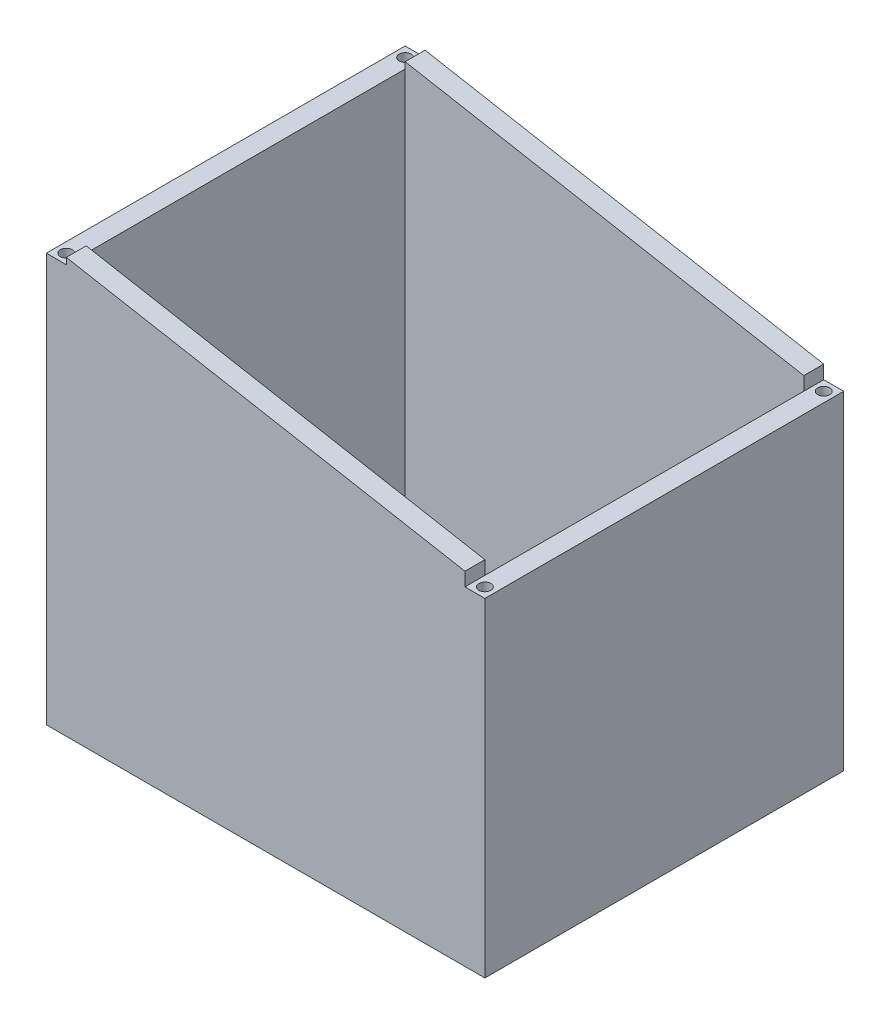
ISO-10303-21;
HEADER;
FILE_DESCRIPTION(('STEP AP214'),'2;1');
FILE_NAME('part.step','',(''),(''),'','','');
FILE_SCHEMA(('AUTOMOTIVE_DESIGN { 1 0 10303 214 1 1 1 1 }'));
ENDSEC;
DATA;
#1=APPLICATION_CONTEXT('core data for automotive mechanical design processes');
#2=APPLICATION_PROTOCOL_DEFINITION('international standard','automotive_design',2000,#1);
#3=PRODUCT_CONTEXT('',#1,'mechanical');
#4=PRODUCT('Part','Part','',(#3));
#5=PRODUCT_RELATED_PRODUCT_CATEGORY('part','',(#4));
#6=PRODUCT_DEFINITION_FORMATION('','',#4);
#7=PRODUCT_DEFINITION_CONTEXT('part definition',#1,'design');
#8=PRODUCT_DEFINITION('design','',#6,#7);
#9=PRODUCT_DEFINITION_SHAPE('','',#8);
#10=(LENGTH_UNIT() NAMED_UNIT(*) SI_UNIT(.MILLI.,.METRE.));
#11=(NAMED_UNIT(*) PLANE_ANGLE_UNIT() SI_UNIT($,.RADIAN.));
#12=(NAMED_UNIT(*) SI_UNIT($,.STERADIAN.) SOLID_ANGLE_UNIT());
#13=UNCERTAINTY_MEASURE_WITH_UNIT(LENGTH_MEASURE(1.E-05),#10,'distance_accuracy_value','');
#14=(GEOMETRIC_REPRESENTATION_CONTEXT(3) GLOBAL_UNCERTAINTY_ASSIGNED_CONTEXT((#13)) GLOBAL_UNIT_ASSIGNED_CONTEXT((#10,
#11,#12)) REPRESENTATION_CONTEXT('',''));
#15=CARTESIAN_POINT('',(0.,0.,0.));
#16=DIRECTION('',(0.,0.,1.));
#17=DIRECTION('',(1.,0.,0.));
#18=AXIS2_PLACEMENT_3D('',#15,#16,#17);
#19=CARTESIAN_POINT('',(55.,60.,-45.));
#20=DIRECTION('',(-0.178885438199983,-0.983869910099907,0.));
#21=DIRECTION('',(0.983869910099907,-0.178885438199983,0.));
#22=AXIS2_PLACEMENT_3D('',#19,#20,#21);
#23=PLANE('',#22);
#24=DIRECTION('',(0.983869910099908,-0.178885438199983,0.));
#25=VECTOR('',#24,1.);
#26=CARTESIAN_POINT('',(55.,60.,-45.));
#27=LINE('',#26,#25);
#28=CARTESIAN_POINT('',(-50.,79.0909090909091,-45.));
#29=VERTEX_POINT('',#28);
#30=CARTESIAN_POINT('',(50.,60.9090909090909,-45.));
#31=VERTEX_POINT('',#30);
#32=EDGE_CURVE('E301',#29,#31,#27,.T.);
#33=ORIENTED_EDGE('',*,*,#32,.F.);
#34=DIRECTION('',(0.,0.,1.));
#35=VECTOR('',#34,1.);
#36=CARTESIAN_POINT('',(-50.,79.0909090909091,-45.));
#37=LINE('',#36,#35);
#38=CARTESIAN_POINT('',(-50.,79.0909090909091,-40.));
#39=VERTEX_POINT('',#38);
#40=EDGE_CURVE('E243',#29,#39,#37,.T.);
#41=ORIENTED_EDGE('',*,*,#40,.T.);
#42=DIRECTION('',(0.983869910099907,-0.178885438199983,0.));
#43=VECTOR('',#42,1.);
#44=CARTESIAN_POINT('',(16.7130971739534,66.9612550592812,-40.));
#45=LINE('',#44,#43);
#46=CARTESIAN_POINT('',(50.,60.9090909090909,-40.));
#47=VERTEX_POINT('',#46);
#48=EDGE_CURVE('E304',#39,#47,#45,.T.);
#49=ORIENTED_EDGE('',*,*,#48,.T.);
#50=DIRECTION('',(0.,0.,1.));
#51=VECTOR('',#50,1.);
#52=CARTESIAN_POINT('',(50.,60.9090909090909,-45.));
#53=LINE('',#52,#51);
#54=EDGE_CURVE('E268',#31,#47,#53,.T.);
#55=ORIENTED_EDGE('',*,*,#54,.F.);
#56=EDGE_LOOP('',(#33,#41,#49,#55));
#57=FACE_BOUND('',#56,.T.);
#58=ADVANCED_FACE('F40',(#57),#23,.F.);
#59=CARTESIAN_POINT('',(0.,-24.9607793974627,40.));
#60=DIRECTION('',(0.,0.,1.));
#61=DIRECTION('',(1.,0.,0.));
#62=AXIS2_PLACEMENT_3D('',#59,#60,#61);
#63=PLANE('',#62);
#64=DIRECTION('',(0.,1.,0.));
#65=VECTOR('',#64,1.);
#66=CARTESIAN_POINT('',(-50.,-24.9607793974627,40.));
#67=LINE('',#66,#65);
#68=CARTESIAN_POINT('',(-50.,-24.9607793974627,40.));
#69=VERTEX_POINT('',#68);
#70=CARTESIAN_POINT('',(-50.,77.5,40.));
#71=VERTEX_POINT('',#70);
#72=EDGE_CURVE('E355',#69,#71,#67,.T.);
#73=ORIENTED_EDGE('',*,*,#72,.T.);
#74=DIRECTION('',(0.,1.,0.));
#75=VECTOR('',#74,1.);
#76=CARTESIAN_POINT('',(-50.,-24.9607793974627,40.));
#77=LINE('',#76,#75);
#78=CARTESIAN_POINT('',(-50.,79.0909090909091,40.));
#79=VERTEX_POINT('',#78);
#80=EDGE_CURVE('E263',#71,#79,#77,.T.);
#81=ORIENTED_EDGE('',*,*,#80,.T.);
#82=DIRECTION('',(0.983869910099907,-0.178885438199983,0.));
#83=VECTOR('',#82,1.);
#84=CARTESIAN_POINT('',(16.7130971739534,66.9612550592812,40.));
#85=LINE('',#84,#83);
#86=CARTESIAN_POINT('',(50.,60.9090909090909,40.));
#87=VERTEX_POINT('',#86);
#88=EDGE_CURVE('E310',#79,#87,#85,.T.);
#89=ORIENTED_EDGE('',*,*,#88,.T.);
#90=DIRECTION('',(0.,1.,0.));
#91=VECTOR('',#90,1.);
#92=CARTESIAN_POINT('',(50.,-24.9607793974627,40.));
#93=LINE('',#92,#91);
#94=CARTESIAN_POINT('',(50.,57.5,40.));
#95=VERTEX_POINT('',#94);
#96=EDGE_CURVE('E50',#95,#87,#93,.T.);
#97=ORIENTED_EDGE('',*,*,#96,.F.);
#98=CARTESIAN_POINT('',(50.,-24.9607793974627,40.));
#99=VERTEX_POINT('',#98);
#100=EDGE_CURVE('E11',#99,#95,#93,.T.);
#101=ORIENTED_EDGE('',*,*,#100,.F.);
#102=DIRECTION('',(1.,0.,0.));
#103=VECTOR('',#102,1.);
#104=CARTESIAN_POINT('',(0.,-24.9607793974627,40.));
#105=LINE('',#104,#103);
#106=EDGE_CURVE('E330',#69,#99,#105,.T.);
#107=ORIENTED_EDGE('',*,*,#106,.F.);
#108=EDGE_LOOP('',(#73,#81,#89,#97,#101,#107));
#109=FACE_BOUND('',#108,.T.);
#110=ADVANCED_FACE('F448',(#109),#63,.F.);
#111=CARTESIAN_POINT('',(50.,-24.9607793974627,0.));
#112=DIRECTION('',(-1.,0.,0.));
#113=DIRECTION('',(0.,0.,1.));
#114=AXIS2_PLACEMENT_3D('',#111,#112,#113);
#115=PLANE('',#114);
#116=DIRECTION('',(0.,0.,-1.));
#117=VECTOR('',#116,1.);
#118=CARTESIAN_POINT('',(50.,57.5,45.));
#119=LINE('',#118,#117);
#120=CARTESIAN_POINT('',(50.,57.5,-40.));
#121=VERTEX_POINT('',#120);
#122=EDGE_CURVE('E282',#95,#121,#119,.T.);
#123=ORIENTED_EDGE('',*,*,#122,.T.);
#124=DIRECTION('',(0.,1.,0.));
#125=VECTOR('',#124,1.);
#126=CARTESIAN_POINT('',(50.,-24.9607793974627,-40.));
#127=LINE('',#126,#125);
#128=CARTESIAN_POINT('',(50.,-24.9607793974627,-40.));
#129=VERTEX_POINT('',#128);
#130=EDGE_CURVE('E346',#129,#121,#127,.T.);
#131=ORIENTED_EDGE('',*,*,#130,.F.);
#132=DIRECTION('',(0.,0.,1.));
#133=VECTOR('',#132,1.);
#134=CARTESIAN_POINT('',(50.,-24.9607793974627,0.));
#135=LINE('',#134,#133);
#136=EDGE_CURVE('E341',#129,#99,#135,.T.);
#137=ORIENTED_EDGE('',*,*,#136,.T.);
#138=ORIENTED_EDGE('',*,*,#100,.T.);
#139=EDGE_LOOP('',(#123,#131,#137,#138));
#140=FACE_BOUND('',#139,.T.);
#141=ADVANCED_FACE('F464',(#140),#115,.T.);
#142=CARTESIAN_POINT('',(0.,-24.9607793974627,-40.));
#143=DIRECTION('',(0.,0.,1.));
#144=DIRECTION('',(1.,0.,0.));
#145=AXIS2_PLACEMENT_3D('',#142,#143,#144);
#146=PLANE('',#145);
#147=ORIENTED_EDGE('',*,*,#48,.F.);
#148=DIRECTION('',(0.,1.,0.));
#149=VECTOR('',#148,1.);
#150=CARTESIAN_POINT('',(-50.,-24.9607793974627,-40.));
#151=LINE('',#150,#149);
#152=CARTESIAN_POINT('',(-50.,77.5,-40.));
#153=VERTEX_POINT('',#152);
#154=EDGE_CURVE('E260',#153,#39,#151,.T.);
#155=ORIENTED_EDGE('',*,*,#154,.F.);
#156=DIRECTION('',(0.,1.,0.));
#157=VECTOR('',#156,1.);
#158=CARTESIAN_POINT('',(-50.,-24.9607793974627,-40.));
#159=LINE('',#158,#157);
#160=CARTESIAN_POINT('',(-50.,-24.9607793974627,-40.));
#161=VERTEX_POINT('',#160);
#162=EDGE_CURVE('E351',#161,#153,#159,.T.);
#163=ORIENTED_EDGE('',*,*,#162,.F.);
#164=DIRECTION('',(1.,0.,0.));
#165=VECTOR('',#164,1.);
#166=CARTESIAN_POINT('',(0.,-24.9607793974627,-40.));
#167=LINE('',#166,#165);
#168=EDGE_CURVE('E337',#161,#129,#167,.T.);
#169=ORIENTED_EDGE('',*,*,#168,.T.);
#170=ORIENTED_EDGE('',*,*,#130,.T.);
#171=EDGE_CURVE('E350',#121,#47,#127,.T.);
#172=ORIENTED_EDGE('',*,*,#171,.T.);
#173=EDGE_LOOP('',(#147,#155,#163,#169,#170,#172));
#174=FACE_BOUND('',#173,.T.);
#175=ADVANCED_FACE('F468',(#174),#146,.T.);
#176=CARTESIAN_POINT('',(-55.,-24.9607793974627,0.));
#177=DIRECTION('',(-1.,0.,0.));
#178=DIRECTION('',(0.,0.,1.));
#179=AXIS2_PLACEMENT_3D('',#176,#177,#178);
#180=PLANE('',#179);
#181=DIRECTION('',(0.,-1.,0.));
#182=VECTOR('',#181,1.);
#183=CARTESIAN_POINT('',(-55.,-11.9607793974627,-29.));
#184=LINE('',#183,#182);
#185=CARTESIAN_POINT('',(-55.,-11.9607793974627,-29.));
#186=VERTEX_POINT('',#185);
#187=CARTESIAN_POINT('',(-55.,-24.9607793974627,-29.));
#188=VERTEX_POINT('',#187);
#189=EDGE_CURVE('E192',#186,#188,#184,.T.);
#190=ORIENTED_EDGE('',*,*,#189,.F.);
#191=DIRECTION('',(0.,0.,-1.));
#192=VECTOR('',#191,1.);
#193=CARTESIAN_POINT('',(-55.,-11.9607793974627,-29.));
#194=LINE('',#193,#192);
#195=CARTESIAN_POINT('',(-55.,-11.9607793974627,29.));
#196=VERTEX_POINT('',#195);
#197=EDGE_CURVE('E195',#196,#186,#194,.T.);
#198=ORIENTED_EDGE('',*,*,#197,.F.);
#199=DIRECTION('',(0.,1.,0.));
#200=VECTOR('',#199,1.);
#201=CARTESIAN_POINT('',(-55.,-11.9607793974627,29.));
#202=LINE('',#201,#200);
#203=CARTESIAN_POINT('',(-55.,-24.9607793974627,29.));
#204=VERTEX_POINT('',#203);
#205=EDGE_CURVE('E170',#204,#196,#202,.T.);
#206=ORIENTED_EDGE('',*,*,#205,.F.);
#207=DIRECTION('',(0.,0.,1.));
#208=VECTOR('',#207,1.);
#209=CARTESIAN_POINT('',(-55.,-24.9607793974627,0.));
#210=LINE('',#209,#208);
#211=CARTESIAN_POINT('',(-55.,-24.9607793974627,45.));
#212=VERTEX_POINT('',#211);
#213=EDGE_CURVE('E314',#204,#212,#210,.T.);
#214=ORIENTED_EDGE('',*,*,#213,.T.);
#215=DIRECTION('',(0.,1.,0.));
#216=VECTOR('',#215,1.);
#217=CARTESIAN_POINT('',(-55.,-24.9607793974627,45.));
#218=LINE('',#217,#216);
#219=CARTESIAN_POINT('',(-55.,77.5,45.));
#220=VERTEX_POINT('',#219);
#221=EDGE_CURVE('E344',#212,#220,#218,.T.);
#222=ORIENTED_EDGE('',*,*,#221,.T.);
#223=DIRECTION('',(0.,0.,1.));
#224=VECTOR('',#223,1.);
#225=CARTESIAN_POINT('',(-55.,77.5,-45.));
#226=LINE('',#225,#224);
#227=CARTESIAN_POINT('',(-55.,77.5,-45.));
#228=VERTEX_POINT('',#227);
#229=EDGE_CURVE('E237',#228,#220,#226,.T.);
#230=ORIENTED_EDGE('',*,*,#229,.F.);
#231=DIRECTION('',(0.,1.,0.));
#232=VECTOR('',#231,1.);
#233=CARTESIAN_POINT('',(-55.,-24.9607793974627,-45.));
#234=LINE('',#233,#232);
#235=CARTESIAN_POINT('',(-55.,-24.9607793974627,-45.));
#236=VERTEX_POINT('',#235);
#237=EDGE_CURVE('E359',#236,#228,#234,.T.);
#238=ORIENTED_EDGE('',*,*,#237,.F.);
#239=EDGE_CURVE('E315',#236,#188,#210,.T.);
#240=ORIENTED_EDGE('',*,*,#239,.T.);
#241=EDGE_LOOP('',(#190,#198,#206,#214,#222,#230,#238,#240));
#242=FACE_BOUND('',#241,.T.);
#243=ADVANCED_FACE('F42',(#242),#180,.T.);
#244=CARTESIAN_POINT('',(0.,-24.9607793974627,-45.));
#245=DIRECTION('',(0.,0.,1.));
#246=DIRECTION('',(1.,0.,0.));
#247=AXIS2_PLACEMENT_3D('',#244,#245,#246);
#248=PLANE('',#247);
#249=DIRECTION('',(1.,0.,0.));
#250=VECTOR('',#249,1.);
#251=CARTESIAN_POINT('',(-55.,77.5,-45.));
#252=LINE('',#251,#250);
#253=CARTESIAN_POINT('',(-50.,77.5,-45.));
#254=VERTEX_POINT('',#253);
#255=EDGE_CURVE('E229',#228,#254,#252,.T.);
#256=ORIENTED_EDGE('',*,*,#255,.T.);
#257=DIRECTION('',(0.,1.,0.));
#258=VECTOR('',#257,1.);
#259=CARTESIAN_POINT('',(-50.,77.5,-45.));
#260=LINE('',#259,#258);
#261=EDGE_CURVE('E233',#254,#29,#260,.T.);
#262=ORIENTED_EDGE('',*,*,#261,.T.);
#263=ORIENTED_EDGE('',*,*,#32,.T.);
#264=DIRECTION('',(0.,1.,0.));
#265=VECTOR('',#264,1.);
#266=CARTESIAN_POINT('',(50.,60.,-45.));
#267=LINE('',#266,#265);
#268=CARTESIAN_POINT('',(50.,57.5,-45.));
#269=VERTEX_POINT('',#268);
#270=EDGE_CURVE('E281',#269,#31,#267,.T.);
#271=ORIENTED_EDGE('',*,*,#270,.F.);
#272=DIRECTION('',(1.,0.,0.));
#273=VECTOR('',#272,1.);
#274=CARTESIAN_POINT('',(50.,57.5,-45.));
#275=LINE('',#274,#273);
#276=CARTESIAN_POINT('',(55.,57.5,-45.));
#277=VERTEX_POINT('',#276);
#278=EDGE_CURVE('E289',#269,#277,#275,.T.);
#279=ORIENTED_EDGE('',*,*,#278,.T.);
#280=DIRECTION('',(0.,1.,0.));
#281=VECTOR('',#280,1.);
#282=CARTESIAN_POINT('',(55.,-24.9607793974627,-45.));
#283=LINE('',#282,#281);
#284=CARTESIAN_POINT('',(55.,-24.9607793974627,-45.));
#285=VERTEX_POINT('',#284);
#286=EDGE_CURVE('E363',#285,#277,#283,.T.);
#287=ORIENTED_EDGE('',*,*,#286,.F.);
#288=DIRECTION('',(1.,0.,0.));
#289=VECTOR('',#288,1.);
#290=CARTESIAN_POINT('',(0.,-24.9607793974627,-45.));
#291=LINE('',#290,#289);
#292=EDGE_CURVE('E327',#236,#285,#291,.T.);
#293=ORIENTED_EDGE('',*,*,#292,.F.);
#294=ORIENTED_EDGE('',*,*,#237,.T.);
#295=EDGE_LOOP('',(#256,#262,#263,#271,#279,#287,#293,#294));
#296=FACE_BOUND('',#295,.T.);
#297=ADVANCED_FACE('F422',(#296),#248,.F.);
#298=CARTESIAN_POINT('',(55.,-24.9607793974627,0.));
#299=DIRECTION('',(1.,0.,0.));
#300=DIRECTION('',(0.,0.,-1.));
#301=AXIS2_PLACEMENT_3D('',#298,#299,#300);
#302=PLANE('',#301);
#303=DIRECTION('',(0.,0.,-1.));
#304=VECTOR('',#303,1.);
#305=CARTESIAN_POINT('',(55.,57.5,45.));
#306=LINE('',#305,#304);
#307=CARTESIAN_POINT('',(55.,57.5,45.));
#308=VERTEX_POINT('',#307);
#309=EDGE_CURVE('E271',#308,#277,#306,.T.);
#310=ORIENTED_EDGE('',*,*,#309,.F.);
#311=DIRECTION('',(0.,1.,0.));
#312=VECTOR('',#311,1.);
#313=CARTESIAN_POINT('',(55.,-24.9607793974627,45.));
#314=LINE('',#313,#312);
#315=CARTESIAN_POINT('',(55.,-24.9607793974627,45.));
#316=VERTEX_POINT('',#315);
#317=EDGE_CURVE('E367',#316,#308,#314,.T.);
#318=ORIENTED_EDGE('',*,*,#317,.F.);
#319=DIRECTION('',(0.,0.,-1.));
#320=VECTOR('',#319,1.);
#321=CARTESIAN_POINT('',(55.,-24.9607793974627,0.));
#322=LINE('',#321,#320);
#323=EDGE_CURVE('E323',#316,#285,#322,.T.);
#324=ORIENTED_EDGE('',*,*,#323,.T.);
#325=ORIENTED_EDGE('',*,*,#286,.T.);
#326=EDGE_LOOP('',(#310,#318,#324,#325));
#327=FACE_BOUND('',#326,.T.);
#328=ADVANCED_FACE('F425',(#327),#302,.T.);
#329=CARTESIAN_POINT('',(0.,-24.9607793974627,45.));
#330=DIRECTION('',(0.,0.,1.));
#331=DIRECTION('',(1.,0.,0.));
#332=AXIS2_PLACEMENT_3D('',#329,#330,#331);
#333=PLANE('',#332);
#334=DIRECTION('',(0.,1.,0.));
#335=VECTOR('',#334,1.);
#336=CARTESIAN_POINT('',(-50.,77.5,45.));
#337=LINE('',#336,#335);
#338=CARTESIAN_POINT('',(-50.,77.5,45.));
#339=VERTEX_POINT('',#338);
#340=CARTESIAN_POINT('',(-50.,79.0909090909091,45.));
#341=VERTEX_POINT('',#340);
#342=EDGE_CURVE('E66',#339,#341,#337,.T.);
#343=ORIENTED_EDGE('',*,*,#342,.F.);
#344=DIRECTION('',(1.,0.,0.));
#345=VECTOR('',#344,1.);
#346=CARTESIAN_POINT('',(-55.,77.5,45.));
#347=LINE('',#346,#345);
#348=EDGE_CURVE('E228',#220,#339,#347,.T.);
#349=ORIENTED_EDGE('',*,*,#348,.F.);
#350=ORIENTED_EDGE('',*,*,#221,.F.);
#351=DIRECTION('',(1.,0.,0.));
#352=VECTOR('',#351,1.);
#353=CARTESIAN_POINT('',(0.,-24.9607793974627,45.));
#354=LINE('',#353,#352);
#355=EDGE_CURVE('E319',#212,#316,#354,.T.);
#356=ORIENTED_EDGE('',*,*,#355,.T.);
#357=ORIENTED_EDGE('',*,*,#317,.T.);
#358=DIRECTION('',(1.,0.,0.));
#359=VECTOR('',#358,1.);
#360=CARTESIAN_POINT('',(50.,57.5,45.));
#361=LINE('',#360,#359);
#362=CARTESIAN_POINT('',(50.,57.5,45.));
#363=VERTEX_POINT('',#362);
#364=EDGE_CURVE('E286',#363,#308,#361,.T.);
#365=ORIENTED_EDGE('',*,*,#364,.F.);
#366=DIRECTION('',(0.,-1.,0.));
#367=VECTOR('',#366,1.);
#368=CARTESIAN_POINT('',(50.,60.,45.));
#369=LINE('',#368,#367);
#370=CARTESIAN_POINT('',(50.,60.9090909090909,45.));
#371=VERTEX_POINT('',#370);
#372=EDGE_CURVE('E272',#371,#363,#369,.T.);
#373=ORIENTED_EDGE('',*,*,#372,.F.);
#374=DIRECTION('',(0.983869910099908,-0.178885438199983,0.));
#375=VECTOR('',#374,1.);
#376=CARTESIAN_POINT('',(55.,60.,45.));
#377=LINE('',#376,#375);
#378=EDGE_CURVE('E300',#341,#371,#377,.T.);
#379=ORIENTED_EDGE('',*,*,#378,.F.);
#380=EDGE_LOOP('',(#343,#349,#350,#356,#357,#365,#373,#379));
#381=FACE_BOUND('',#380,.T.);
#382=ADVANCED_FACE('F428',(#381),#333,.T.);
#383=CARTESIAN_POINT('',(-50.,-24.9607793974627,0.));
#384=DIRECTION('',(-1.,0.,0.));
#385=DIRECTION('',(0.,0.,1.));
#386=AXIS2_PLACEMENT_3D('',#383,#384,#385);
#387=PLANE('',#386);
#388=DIRECTION('',(0.,0.,-1.));
#389=VECTOR('',#388,1.);
#390=CARTESIAN_POINT('',(-50.,-11.9607793974627,-29.));
#391=LINE('',#390,#389);
#392=CARTESIAN_POINT('',(-50.,-11.9607793974627,29.));
#393=VERTEX_POINT('',#392);
#394=CARTESIAN_POINT('',(-50.,-11.9607793974627,-29.));
#395=VERTEX_POINT('',#394);
#396=EDGE_CURVE('E179',#393,#395,#391,.T.);
#397=ORIENTED_EDGE('',*,*,#396,.T.);
#398=DIRECTION('',(0.,-1.,0.));
#399=VECTOR('',#398,1.);
#400=CARTESIAN_POINT('',(-50.,-11.9607793974627,-29.));
#401=LINE('',#400,#399);
#402=CARTESIAN_POINT('',(-50.,-24.9607793974627,-29.));
#403=VERTEX_POINT('',#402);
#404=EDGE_CURVE('E185',#395,#403,#401,.T.);
#405=ORIENTED_EDGE('',*,*,#404,.T.);
#406=DIRECTION('',(0.,0.,1.));
#407=VECTOR('',#406,1.);
#408=CARTESIAN_POINT('',(-50.,-24.9607793974627,0.));
#409=LINE('',#408,#407);
#410=EDGE_CURVE('E333',#161,#403,#409,.T.);
#411=ORIENTED_EDGE('',*,*,#410,.F.);
#412=ORIENTED_EDGE('',*,*,#162,.T.);
#413=DIRECTION('',(0.,0.,1.));
#414=VECTOR('',#413,1.);
#415=CARTESIAN_POINT('',(-50.,77.5,-45.));
#416=LINE('',#415,#414);
#417=EDGE_CURVE('E252',#153,#71,#416,.T.);
#418=ORIENTED_EDGE('',*,*,#417,.T.);
#419=ORIENTED_EDGE('',*,*,#72,.F.);
#420=CARTESIAN_POINT('',(-50.,-24.9607793974627,29.));
#421=VERTEX_POINT('',#420);
#422=EDGE_CURVE('E190',#421,#69,#409,.T.);
#423=ORIENTED_EDGE('',*,*,#422,.F.);
#424=DIRECTION('',(0.,1.,0.));
#425=VECTOR('',#424,1.);
#426=CARTESIAN_POINT('',(-50.,-11.9607793974627,29.));
#427=LINE('',#426,#425);
#428=EDGE_CURVE('E58',#421,#393,#427,.T.);
#429=ORIENTED_EDGE('',*,*,#428,.T.);
#430=EDGE_LOOP('',(#397,#405,#411,#412,#418,#419,#423,#429));
#431=FACE_BOUND('',#430,.T.);
#432=ADVANCED_FACE('F188',(#431),#387,.F.);
#433=CARTESIAN_POINT('',(0.,-24.9607793974627,0.));
#434=DIRECTION('',(0.,1.,0.));
#435=DIRECTION('',(0.,0.,1.));
#436=AXIS2_PLACEMENT_3D('',#433,#434,#435);
#437=PLANE('',#436);
#438=CARTESIAN_POINT('',(-52.5,-24.9607793974627,-42.5));
#439=DIRECTION('',(0.,1.,0.));
#440=DIRECTION('',(0.,0.,1.));
#441=AXIS2_PLACEMENT_3D('',#438,#439,#440);
#442=CIRCLE('',#441,1.5);
#443=CARTESIAN_POINT('',(-52.5,-24.9607793974627,-41.));
#444=VERTEX_POINT('',#443);
#445=EDGE_CURVE('E208',#444,#444,#442,.T.);
#446=ORIENTED_EDGE('',*,*,#445,.T.);
#447=EDGE_LOOP('',(#446));
#448=FACE_BOUND('',#447,.T.);
#449=CARTESIAN_POINT('',(52.5,-24.9607793974627,-42.5));
#450=DIRECTION('',(0.,1.,0.));
#451=DIRECTION('',(0.,0.,1.));
#452=AXIS2_PLACEMENT_3D('',#449,#450,#451);
#453=CIRCLE('',#452,1.5);
#454=CARTESIAN_POINT('',(52.5,-24.9607793974627,-41.));
#455=VERTEX_POINT('',#454);
#456=EDGE_CURVE('E216',#455,#455,#453,.T.);
#457=ORIENTED_EDGE('',*,*,#456,.T.);
#458=EDGE_LOOP('',(#457));
#459=FACE_BOUND('',#458,.T.);
#460=CARTESIAN_POINT('',(52.5000000000001,-24.9607793974627,42.5));
#461=DIRECTION('',(0.,1.,0.));
#462=DIRECTION('',(0.,0.,1.));
#463=AXIS2_PLACEMENT_3D('',#460,#461,#462);
#464=CIRCLE('',#463,1.5);
#465=CARTESIAN_POINT('',(52.5000000000001,-24.9607793974627,44.));
#466=VERTEX_POINT('',#465);
#467=EDGE_CURVE('E220',#466,#466,#464,.T.);
#468=ORIENTED_EDGE('',*,*,#467,.T.);
#469=EDGE_LOOP('',(#468));
#470=FACE_BOUND('',#469,.T.);
#471=CARTESIAN_POINT('',(-52.5,-24.9607793974627,42.5));
#472=DIRECTION('',(0.,1.,0.));
#473=DIRECTION('',(0.,0.,1.));
#474=AXIS2_PLACEMENT_3D('',#471,#472,#473);
#475=CIRCLE('',#474,1.5);
#476=CARTESIAN_POINT('',(-52.5,-24.9607793974627,44.));
#477=VERTEX_POINT('',#476);
#478=EDGE_CURVE('E224',#477,#477,#475,.T.);
#479=ORIENTED_EDGE('',*,*,#478,.T.);
#480=EDGE_LOOP('',(#479));
#481=FACE_BOUND('',#480,.T.);
#482=ORIENTED_EDGE('',*,*,#410,.T.);
#483=DIRECTION('',(-1.,0.,0.));
#484=VECTOR('',#483,1.);
#485=CARTESIAN_POINT('',(-50.,-24.9607793974627,-29.));
#486=LINE('',#485,#484);
#487=EDGE_CURVE('E204',#403,#188,#486,.T.);
#488=ORIENTED_EDGE('',*,*,#487,.T.);
#489=ORIENTED_EDGE('',*,*,#239,.F.);
#490=ORIENTED_EDGE('',*,*,#292,.T.);
#491=ORIENTED_EDGE('',*,*,#323,.F.);
#492=ORIENTED_EDGE('',*,*,#355,.F.);
#493=ORIENTED_EDGE('',*,*,#213,.F.);
#494=DIRECTION('',(-1.,0.,0.));
#495=VECTOR('',#494,1.);
#496=CARTESIAN_POINT('',(-50.,-24.9607793974627,29.));
#497=LINE('',#496,#495);
#498=EDGE_CURVE('E176',#421,#204,#497,.T.);
#499=ORIENTED_EDGE('',*,*,#498,.F.);
#500=ORIENTED_EDGE('',*,*,#422,.T.);
#501=ORIENTED_EDGE('',*,*,#106,.T.);
#502=ORIENTED_EDGE('',*,*,#136,.F.);
#503=ORIENTED_EDGE('',*,*,#168,.F.);
#504=EDGE_LOOP('',(#482,#488,#489,#490,#491,#492,#493,#499,#500,#501,#502,#503));
#505=FACE_BOUND('',#504,.T.);
#506=ADVANCED_FACE('F397',(#448,#459,#470,#481,#505),#437,.F.);
#507=ORIENTED_EDGE('',*,*,#88,.F.);
#508=EDGE_CURVE('E247',#79,#341,#37,.T.);
#509=ORIENTED_EDGE('',*,*,#508,.T.);
#510=ORIENTED_EDGE('',*,*,#378,.T.);
#511=EDGE_CURVE('E267',#87,#371,#53,.T.);
#512=ORIENTED_EDGE('',*,*,#511,.F.);
#513=EDGE_LOOP('',(#507,#509,#510,#512));
#514=FACE_BOUND('',#513,.T.);
#515=ADVANCED_FACE('F400',(#514),#23,.F.);
#516=CARTESIAN_POINT('',(50.,0.,0.));
#517=DIRECTION('',(1.,0.,0.));
#518=DIRECTION('',(0.,0.,-1.));
#519=AXIS2_PLACEMENT_3D('',#516,#517,#518);
#520=PLANE('',#519);
#521=EDGE_CURVE('E277',#363,#95,#119,.T.);
#522=ORIENTED_EDGE('',*,*,#521,.T.);
#523=ORIENTED_EDGE('',*,*,#96,.T.);
#524=ORIENTED_EDGE('',*,*,#511,.T.);
#525=ORIENTED_EDGE('',*,*,#372,.T.);
#526=EDGE_LOOP('',(#522,#523,#524,#525));
#527=FACE_BOUND('',#526,.T.);
#528=ADVANCED_FACE('F384',(#527),#520,.T.);
#529=CARTESIAN_POINT('',(50.,57.5,45.));
#530=DIRECTION('',(0.,-1.,0.));
#531=DIRECTION('',(0.,0.,-1.));
#532=AXIS2_PLACEMENT_3D('',#529,#530,#531);
#533=PLANE('',#532);
#534=CARTESIAN_POINT('',(52.5000000000001,57.5,42.5));
#535=DIRECTION('',(0.,-1.,0.));
#536=DIRECTION('',(0.,0.,-1.));
#537=AXIS2_PLACEMENT_3D('',#534,#535,#536);
#538=CIRCLE('',#537,1.5);
#539=CARTESIAN_POINT('',(52.5000000000001,57.5,41.));
#540=VERTEX_POINT('',#539);
#541=EDGE_CURVE('E293',#540,#540,#538,.F.);
#542=ORIENTED_EDGE('',*,*,#541,.F.);
#543=EDGE_LOOP('',(#542));
#544=FACE_BOUND('',#543,.T.);
#545=ORIENTED_EDGE('',*,*,#309,.T.);
#546=ORIENTED_EDGE('',*,*,#278,.F.);
#547=EDGE_CURVE('E276',#121,#269,#119,.T.);
#548=ORIENTED_EDGE('',*,*,#547,.F.);
#549=ORIENTED_EDGE('',*,*,#122,.F.);
#550=ORIENTED_EDGE('',*,*,#521,.F.);
#551=ORIENTED_EDGE('',*,*,#364,.T.);
#552=EDGE_LOOP('',(#545,#546,#548,#549,#550,#551));
#553=FACE_BOUND('',#552,.T.);
#554=CARTESIAN_POINT('',(52.5,57.5,-42.5));
#555=DIRECTION('',(0.,-1.,0.));
#556=DIRECTION('',(0.,0.,-1.));
#557=AXIS2_PLACEMENT_3D('',#554,#555,#556);
#558=CIRCLE('',#557,1.5);
#559=CARTESIAN_POINT('',(52.5,57.5,-44.));
#560=VERTEX_POINT('',#559);
#561=EDGE_CURVE('E296',#560,#560,#558,.F.);
#562=ORIENTED_EDGE('',*,*,#561,.F.);
#563=EDGE_LOOP('',(#562));
#564=FACE_BOUND('',#563,.T.);
#565=ADVANCED_FACE('F380',(#544,#553,#564),#533,.F.);
#566=ORIENTED_EDGE('',*,*,#547,.T.);
#567=ORIENTED_EDGE('',*,*,#270,.T.);
#568=ORIENTED_EDGE('',*,*,#54,.T.);
#569=ORIENTED_EDGE('',*,*,#171,.F.);
#570=EDGE_LOOP('',(#566,#567,#568,#569));
#571=FACE_BOUND('',#570,.T.);
#572=ADVANCED_FACE('F383',(#571),#520,.T.);
#573=CARTESIAN_POINT('',(52.5,0.,-42.5));
#574=DIRECTION('',(0.,1.,0.));
#575=DIRECTION('',(0.,0.,1.));
#576=AXIS2_PLACEMENT_3D('',#573,#574,#575);
#577=CYLINDRICAL_SURFACE('',#576,1.5);
#578=ORIENTED_EDGE('',*,*,#561,.T.);
#579=EDGE_LOOP('',(#578));
#580=FACE_BOUND('',#579,.T.);
#581=ORIENTED_EDGE('',*,*,#456,.F.);
#582=EDGE_LOOP('',(#581));
#583=FACE_BOUND('',#582,.T.);
#584=ADVANCED_FACE('F391',(#580,#583),#577,.F.);
#585=CARTESIAN_POINT('',(52.5000000000001,0.,42.5));
#586=DIRECTION('',(0.,1.,0.));
#587=DIRECTION('',(0.,0.,1.));
#588=AXIS2_PLACEMENT_3D('',#585,#586,#587);
#589=CYLINDRICAL_SURFACE('',#588,1.5);
#590=ORIENTED_EDGE('',*,*,#541,.T.);
#591=EDGE_LOOP('',(#590));
#592=FACE_BOUND('',#591,.T.);
#593=ORIENTED_EDGE('',*,*,#467,.F.);
#594=EDGE_LOOP('',(#593));
#595=FACE_BOUND('',#594,.T.);
#596=ADVANCED_FACE('F377',(#592,#595),#589,.F.);
#597=CARTESIAN_POINT('',(-50.,77.5,-45.));
#598=DIRECTION('',(1.,0.,0.));
#599=DIRECTION('',(0.,0.,-1.));
#600=AXIS2_PLACEMENT_3D('',#597,#598,#599);
#601=PLANE('',#600);
#602=EDGE_CURVE('E253',#71,#339,#416,.T.);
#603=ORIENTED_EDGE('',*,*,#602,.T.);
#604=ORIENTED_EDGE('',*,*,#342,.T.);
#605=ORIENTED_EDGE('',*,*,#508,.F.);
#606=ORIENTED_EDGE('',*,*,#80,.F.);
#607=EDGE_LOOP('',(#603,#604,#605,#606));
#608=FACE_BOUND('',#607,.T.);
#609=ADVANCED_FACE('F451',(#608),#601,.F.);
#610=CARTESIAN_POINT('',(-55.,77.5,-45.));
#611=DIRECTION('',(0.,-1.,0.));
#612=DIRECTION('',(0.,0.,-1.));
#613=AXIS2_PLACEMENT_3D('',#610,#611,#612);
#614=PLANE('',#613);
#615=CARTESIAN_POINT('',(-52.5,77.5,-42.5));
#616=DIRECTION('',(0.,-1.,0.));
#617=DIRECTION('',(0.,0.,-1.));
#618=AXIS2_PLACEMENT_3D('',#615,#616,#617);
#619=CIRCLE('',#618,1.5);
#620=CARTESIAN_POINT('',(-52.5,77.5,-44.));
#621=VERTEX_POINT('',#620);
#622=EDGE_CURVE('E44',#621,#621,#619,.F.);
#623=ORIENTED_EDGE('',*,*,#622,.F.);
#624=EDGE_LOOP('',(#623));
#625=FACE_BOUND('',#624,.T.);
#626=ORIENTED_EDGE('',*,*,#348,.T.);
#627=ORIENTED_EDGE('',*,*,#602,.F.);
#628=ORIENTED_EDGE('',*,*,#417,.F.);
#629=EDGE_CURVE('E248',#254,#153,#416,.T.);
#630=ORIENTED_EDGE('',*,*,#629,.F.);
#631=ORIENTED_EDGE('',*,*,#255,.F.);
#632=ORIENTED_EDGE('',*,*,#229,.T.);
#633=EDGE_LOOP('',(#626,#627,#628,#630,#631,#632));
#634=FACE_BOUND('',#633,.T.);
#635=CARTESIAN_POINT('',(-52.5,77.5,42.5));
#636=DIRECTION('',(0.,-1.,0.));
#637=DIRECTION('',(0.,0.,-1.));
#638=AXIS2_PLACEMENT_3D('',#635,#636,#637);
#639=CIRCLE('',#638,1.5);
#640=CARTESIAN_POINT('',(-52.5,77.5,41.));
#641=VERTEX_POINT('',#640);
#642=EDGE_CURVE('E256',#641,#641,#639,.F.);
#643=ORIENTED_EDGE('',*,*,#642,.F.);
#644=EDGE_LOOP('',(#643));
#645=FACE_BOUND('',#644,.T.);
#646=ADVANCED_FACE('F453',(#625,#634,#645),#614,.F.);
#647=ORIENTED_EDGE('',*,*,#154,.T.);
#648=ORIENTED_EDGE('',*,*,#40,.F.);
#649=ORIENTED_EDGE('',*,*,#261,.F.);
#650=ORIENTED_EDGE('',*,*,#629,.T.);
#651=EDGE_LOOP('',(#647,#648,#649,#650));
#652=FACE_BOUND('',#651,.T.);
#653=ADVANCED_FACE('F471',(#652),#601,.F.);
#654=CARTESIAN_POINT('',(-52.5,0.,42.5));
#655=DIRECTION('',(0.,1.,0.));
#656=DIRECTION('',(0.,0.,1.));
#657=AXIS2_PLACEMENT_3D('',#654,#655,#656);
#658=CYLINDRICAL_SURFACE('',#657,1.5);
#659=ORIENTED_EDGE('',*,*,#642,.T.);
#660=EDGE_LOOP('',(#659));
#661=FACE_BOUND('',#660,.T.);
#662=ORIENTED_EDGE('',*,*,#478,.F.);
#663=EDGE_LOOP('',(#662));
#664=FACE_BOUND('',#663,.T.);
#665=ADVANCED_FACE('F606',(#661,#664),#658,.F.);
#666=CARTESIAN_POINT('',(-52.5,0.,-42.5));
#667=DIRECTION('',(0.,1.,0.));
#668=DIRECTION('',(0.,0.,1.));
#669=AXIS2_PLACEMENT_3D('',#666,#667,#668);
#670=CYLINDRICAL_SURFACE('',#669,1.5);
#671=ORIENTED_EDGE('',*,*,#622,.T.);
#672=EDGE_LOOP('',(#671));
#673=FACE_BOUND('',#672,.T.);
#674=ORIENTED_EDGE('',*,*,#445,.F.);
#675=EDGE_LOOP('',(#674));
#676=FACE_BOUND('',#675,.T.);
#677=ADVANCED_FACE('F582',(#673,#676),#670,.F.);
#678=CARTESIAN_POINT('',(-50.,-11.9607793974627,-29.));
#679=DIRECTION('',(0.,0.,-1.));
#680=DIRECTION('',(-1.,0.,0.));
#681=AXIS2_PLACEMENT_3D('',#678,#679,#680);
#682=PLANE('',#681);
#683=ORIENTED_EDGE('',*,*,#189,.T.);
#684=ORIENTED_EDGE('',*,*,#487,.F.);
#685=ORIENTED_EDGE('',*,*,#404,.F.);
#686=DIRECTION('',(-1.,0.,0.));
#687=VECTOR('',#686,1.);
#688=CARTESIAN_POINT('',(-50.,-11.9607793974627,-29.));
#689=LINE('',#688,#687);
#690=EDGE_CURVE('E175',#395,#186,#689,.T.);
#691=ORIENTED_EDGE('',*,*,#690,.T.);
#692=EDGE_LOOP('',(#683,#684,#685,#691));
#693=FACE_BOUND('',#692,.T.);
#694=ADVANCED_FACE('F413',(#693),#682,.F.);
#695=CARTESIAN_POINT('',(-50.,-11.9607793974627,-29.));
#696=DIRECTION('',(0.,1.,0.));
#697=DIRECTION('',(0.,0.,1.));
#698=AXIS2_PLACEMENT_3D('',#695,#696,#697);
#699=PLANE('',#698);
#700=ORIENTED_EDGE('',*,*,#197,.T.);
#701=ORIENTED_EDGE('',*,*,#690,.F.);
#702=ORIENTED_EDGE('',*,*,#396,.F.);
#703=DIRECTION('',(-1.,0.,0.));
#704=VECTOR('',#703,1.);
#705=CARTESIAN_POINT('',(-50.,-11.9607793974627,29.));
#706=LINE('',#705,#704);
#707=EDGE_CURVE('E166',#393,#196,#706,.T.);
#708=ORIENTED_EDGE('',*,*,#707,.T.);
#709=EDGE_LOOP('',(#700,#701,#702,#708));
#710=FACE_BOUND('',#709,.T.);
#711=ADVANCED_FACE('F180',(#710),#699,.F.);
#712=CARTESIAN_POINT('',(-50.,-11.9607793974627,29.));
#713=DIRECTION('',(0.,0.,1.));
#714=DIRECTION('',(1.,0.,0.));
#715=AXIS2_PLACEMENT_3D('',#712,#713,#714);
#716=PLANE('',#715);
#717=ORIENTED_EDGE('',*,*,#205,.T.);
#718=ORIENTED_EDGE('',*,*,#707,.F.);
#719=ORIENTED_EDGE('',*,*,#428,.F.);
#720=ORIENTED_EDGE('',*,*,#498,.T.);
#721=EDGE_LOOP('',(#717,#718,#719,#720));
#722=FACE_BOUND('',#721,.T.);
#723=ADVANCED_FACE('F168',(#722),#716,.F.);
#724=CLOSED_SHELL('',(#58,#110,#141,#175,#243,#297,#328,#382,#432,#506,#515,#528,#565,#572,#584,
#596,#609,#646,#653,#665,#677,#694,#711,#723));
#725=MANIFOLD_SOLID_BREP('B2',#724);
#726=ADVANCED_BREP_SHAPE_REPRESENTATION('',(#18,#725),#14);
#727=SHAPE_DEFINITION_REPRESENTATION(#9,#726);
ENDSEC;
END-ISO-10303-21;
